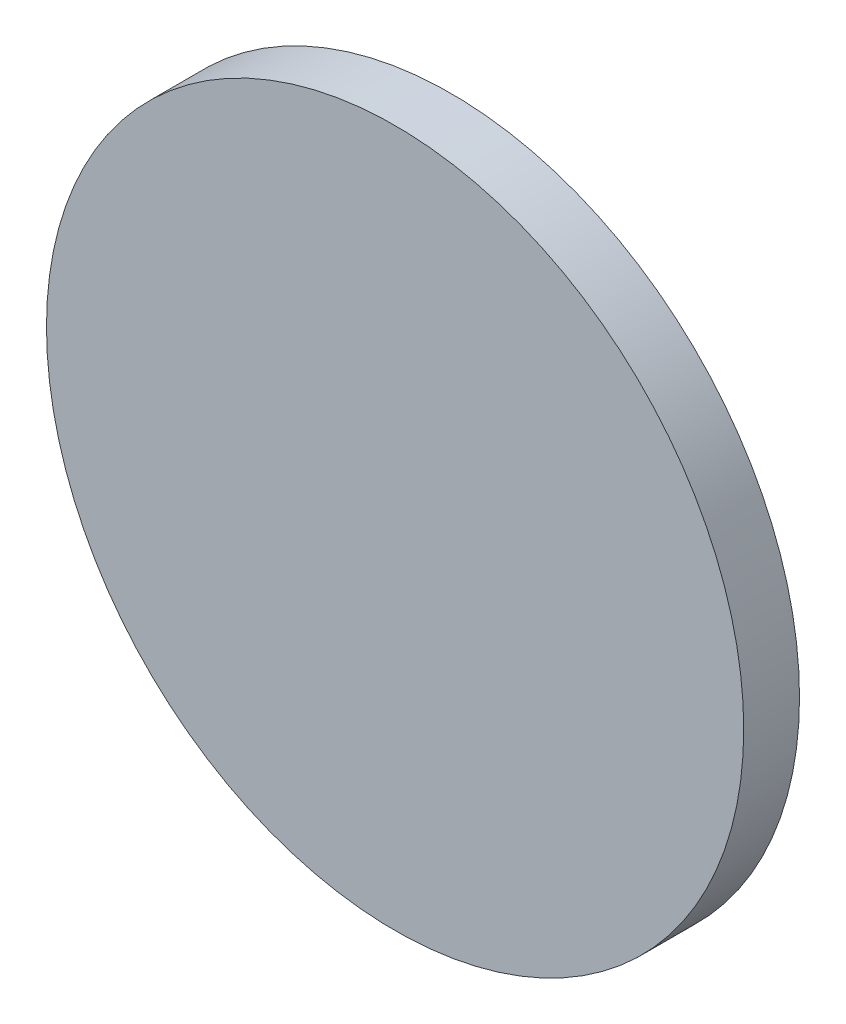
ISO-10303-21;
HEADER;
FILE_DESCRIPTION(('STEP AP214'),'2;1');
FILE_NAME('part.step','',(''),(''),'','','');
FILE_SCHEMA(('AUTOMOTIVE_DESIGN { 1 0 10303 214 1 1 1 1 }'));
ENDSEC;
DATA;
#1=APPLICATION_CONTEXT('core data for automotive mechanical design processes');
#2=APPLICATION_PROTOCOL_DEFINITION('international standard','automotive_design',2000,#1);
#3=PRODUCT_CONTEXT('',#1,'mechanical');
#4=PRODUCT('Part','Part','',(#3));
#5=PRODUCT_RELATED_PRODUCT_CATEGORY('part','',(#4));
#6=PRODUCT_DEFINITION_FORMATION('','',#4);
#7=PRODUCT_DEFINITION_CONTEXT('part definition',#1,'design');
#8=PRODUCT_DEFINITION('design','',#6,#7);
#9=PRODUCT_DEFINITION_SHAPE('','',#8);
#10=(LENGTH_UNIT() NAMED_UNIT(*) SI_UNIT(.MILLI.,.METRE.));
#11=(NAMED_UNIT(*) PLANE_ANGLE_UNIT() SI_UNIT($,.RADIAN.));
#12=(NAMED_UNIT(*) SI_UNIT($,.STERADIAN.) SOLID_ANGLE_UNIT());
#13=UNCERTAINTY_MEASURE_WITH_UNIT(LENGTH_MEASURE(1.E-05),#10,'distance_accuracy_value','');
#14=(GEOMETRIC_REPRESENTATION_CONTEXT(3) GLOBAL_UNCERTAINTY_ASSIGNED_CONTEXT((#13)) GLOBAL_UNIT_ASSIGNED_CONTEXT((#10,
#11,#12)) REPRESENTATION_CONTEXT('',''));
#15=CARTESIAN_POINT('',(0.,0.,0.));
#16=DIRECTION('',(0.,0.,1.));
#17=DIRECTION('',(1.,0.,0.));
#18=AXIS2_PLACEMENT_3D('',#15,#16,#17);
#19=CARTESIAN_POINT('',(0.,0.,2.));
#20=DIRECTION('',(0.,0.,-1.));
#21=DIRECTION('',(-1.,0.,0.));
#22=AXIS2_PLACEMENT_3D('',#19,#20,#21);
#23=CYLINDRICAL_SURFACE('',#22,12.5);
#24=CARTESIAN_POINT('',(0.,0.,2.));
#25=DIRECTION('',(0.,0.,1.));
#26=DIRECTION('',(1.,0.,0.));
#27=AXIS2_PLACEMENT_3D('',#24,#25,#26);
#28=CIRCLE('',#27,12.5);
#29=CARTESIAN_POINT('',(12.5,0.,2.));
#30=VERTEX_POINT('',#29);
#31=EDGE_CURVE('E10',#30,#30,#28,.T.);
#32=ORIENTED_EDGE('',*,*,#31,.F.);
#33=EDGE_LOOP('',(#32));
#34=FACE_BOUND('',#33,.T.);
#35=CARTESIAN_POINT('',(0.,0.,0.));
#36=DIRECTION('',(0.,0.,1.));
#37=DIRECTION('',(1.,0.,0.));
#38=AXIS2_PLACEMENT_3D('',#35,#36,#37);
#39=CIRCLE('',#38,12.5);
#40=CARTESIAN_POINT('',(12.5,0.,0.));
#41=VERTEX_POINT('',#40);
#42=EDGE_CURVE('E36',#41,#41,#39,.T.);
#43=ORIENTED_EDGE('',*,*,#42,.T.);
#44=EDGE_LOOP('',(#43));
#45=FACE_BOUND('',#44,.T.);
#46=ADVANCED_FACE('F33',(#34,#45),#23,.T.);
#47=CARTESIAN_POINT('',(0.,0.,2.));
#48=DIRECTION('',(0.,0.,1.));
#49=DIRECTION('',(1.,0.,0.));
#50=AXIS2_PLACEMENT_3D('',#47,#48,#49);
#51=PLANE('',#50);
#52=ORIENTED_EDGE('',*,*,#31,.T.);
#53=EDGE_LOOP('',(#52));
#54=FACE_BOUND('',#53,.T.);
#55=ADVANCED_FACE('F48',(#54),#51,.T.);
#56=CARTESIAN_POINT('',(0.,0.,0.));
#57=DIRECTION('',(0.,0.,1.));
#58=DIRECTION('',(1.,0.,0.));
#59=AXIS2_PLACEMENT_3D('',#56,#57,#58);
#60=PLANE('',#59);
#61=ORIENTED_EDGE('',*,*,#42,.F.);
#62=EDGE_LOOP('',(#61));
#63=FACE_BOUND('',#62,.T.);
#64=ADVANCED_FACE('F46',(#63),#60,.F.);
#65=CLOSED_SHELL('',(#46,#55,#64));
#66=MANIFOLD_SOLID_BREP('B2',#65);
#67=ADVANCED_BREP_SHAPE_REPRESENTATION('',(#18,#66),#14);
#68=SHAPE_DEFINITION_REPRESENTATION(#9,#67);
ENDSEC;
END-ISO-10303-21;
